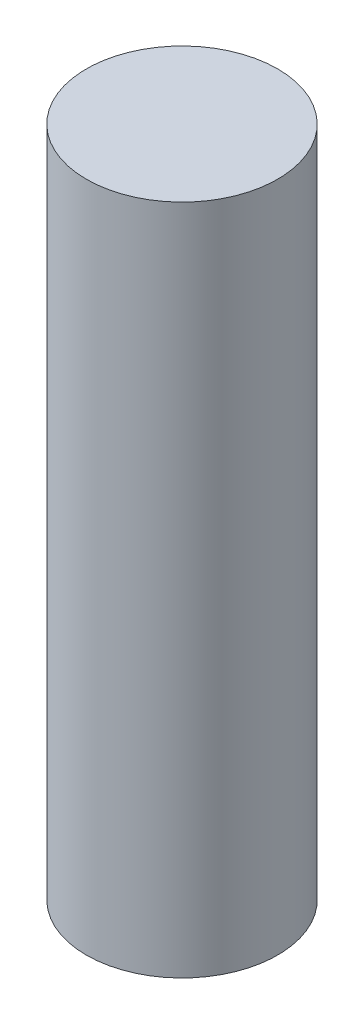
ISO-10303-21;
HEADER;
FILE_DESCRIPTION(('STEP AP214'),'2;1');
FILE_NAME('part.step','',(''),(''),'','','');
FILE_SCHEMA(('AUTOMOTIVE_DESIGN { 1 0 10303 214 1 1 1 1 }'));
ENDSEC;
DATA;
#1=APPLICATION_CONTEXT('core data for automotive mechanical design processes');
#2=APPLICATION_PROTOCOL_DEFINITION('international standard','automotive_design',2000,#1);
#3=PRODUCT_CONTEXT('',#1,'mechanical');
#4=PRODUCT('Part','Part','',(#3));
#5=PRODUCT_RELATED_PRODUCT_CATEGORY('part','',(#4));
#6=PRODUCT_DEFINITION_FORMATION('','',#4);
#7=PRODUCT_DEFINITION_CONTEXT('part definition',#1,'design');
#8=PRODUCT_DEFINITION('design','',#6,#7);
#9=PRODUCT_DEFINITION_SHAPE('','',#8);
#10=(LENGTH_UNIT() NAMED_UNIT(*) SI_UNIT(.MILLI.,.METRE.));
#11=(NAMED_UNIT(*) PLANE_ANGLE_UNIT() SI_UNIT($,.RADIAN.));
#12=(NAMED_UNIT(*) SI_UNIT($,.STERADIAN.) SOLID_ANGLE_UNIT());
#13=UNCERTAINTY_MEASURE_WITH_UNIT(LENGTH_MEASURE(1.E-05),#10,'distance_accuracy_value','');
#14=(GEOMETRIC_REPRESENTATION_CONTEXT(3) GLOBAL_UNCERTAINTY_ASSIGNED_CONTEXT((#13)) GLOBAL_UNIT_ASSIGNED_CONTEXT((#10,
#11,#12)) REPRESENTATION_CONTEXT('',''));
#15=CARTESIAN_POINT('',(0.,0.,0.));
#16=DIRECTION('',(0.,0.,1.));
#17=DIRECTION('',(1.,0.,0.));
#18=AXIS2_PLACEMENT_3D('',#15,#16,#17);
#19=CARTESIAN_POINT('',(0.,65.,0.));
#20=DIRECTION('',(0.,-1.,0.));
#21=DIRECTION('',(0.,0.,-1.));
#22=AXIS2_PLACEMENT_3D('',#19,#20,#21);
#23=CYLINDRICAL_SURFACE('',#22,9.25000000000001);
#24=CARTESIAN_POINT('',(0.,65.,0.));
#25=DIRECTION('',(0.,1.,0.));
#26=DIRECTION('',(0.,0.,1.));
#27=AXIS2_PLACEMENT_3D('',#24,#25,#26);
#28=CIRCLE('',#27,9.25000000000001);
#29=CARTESIAN_POINT('',(0.,65.,9.25000000000001));
#30=VERTEX_POINT('',#29);
#31=EDGE_CURVE('E10',#30,#30,#28,.T.);
#32=ORIENTED_EDGE('',*,*,#31,.F.);
#33=EDGE_LOOP('',(#32));
#34=FACE_BOUND('',#33,.T.);
#35=CARTESIAN_POINT('',(0.,0.,0.));
#36=DIRECTION('',(0.,1.,0.));
#37=DIRECTION('',(0.,0.,1.));
#38=AXIS2_PLACEMENT_3D('',#35,#36,#37);
#39=CIRCLE('',#38,9.25000000000001);
#40=CARTESIAN_POINT('',(0.,0.,9.25000000000001));
#41=VERTEX_POINT('',#40);
#42=EDGE_CURVE('E33',#41,#41,#39,.T.);
#43=ORIENTED_EDGE('',*,*,#42,.T.);
#44=EDGE_LOOP('',(#43));
#45=FACE_BOUND('',#44,.T.);
#46=ADVANCED_FACE('F30',(#34,#45),#23,.T.);
#47=CARTESIAN_POINT('',(0.,65.,0.));
#48=DIRECTION('',(0.,1.,0.));
#49=DIRECTION('',(0.,0.,1.));
#50=AXIS2_PLACEMENT_3D('',#47,#48,#49);
#51=PLANE('',#50);
#52=ORIENTED_EDGE('',*,*,#31,.T.);
#53=EDGE_LOOP('',(#52));
#54=FACE_BOUND('',#53,.T.);
#55=ADVANCED_FACE('F45',(#54),#51,.T.);
#56=CARTESIAN_POINT('',(0.,0.,0.));
#57=DIRECTION('',(0.,1.,0.));
#58=DIRECTION('',(0.,0.,1.));
#59=AXIS2_PLACEMENT_3D('',#56,#57,#58);
#60=PLANE('',#59);
#61=ORIENTED_EDGE('',*,*,#42,.F.);
#62=EDGE_LOOP('',(#61));
#63=FACE_BOUND('',#62,.T.);
#64=ADVANCED_FACE('F43',(#63),#60,.F.);
#65=CLOSED_SHELL('',(#46,#55,#64));
#66=MANIFOLD_SOLID_BREP('B2',#65);
#67=ADVANCED_BREP_SHAPE_REPRESENTATION('',(#18,#66),#14);
#68=SHAPE_DEFINITION_REPRESENTATION(#9,#67);
ENDSEC;
END-ISO-10303-21;
